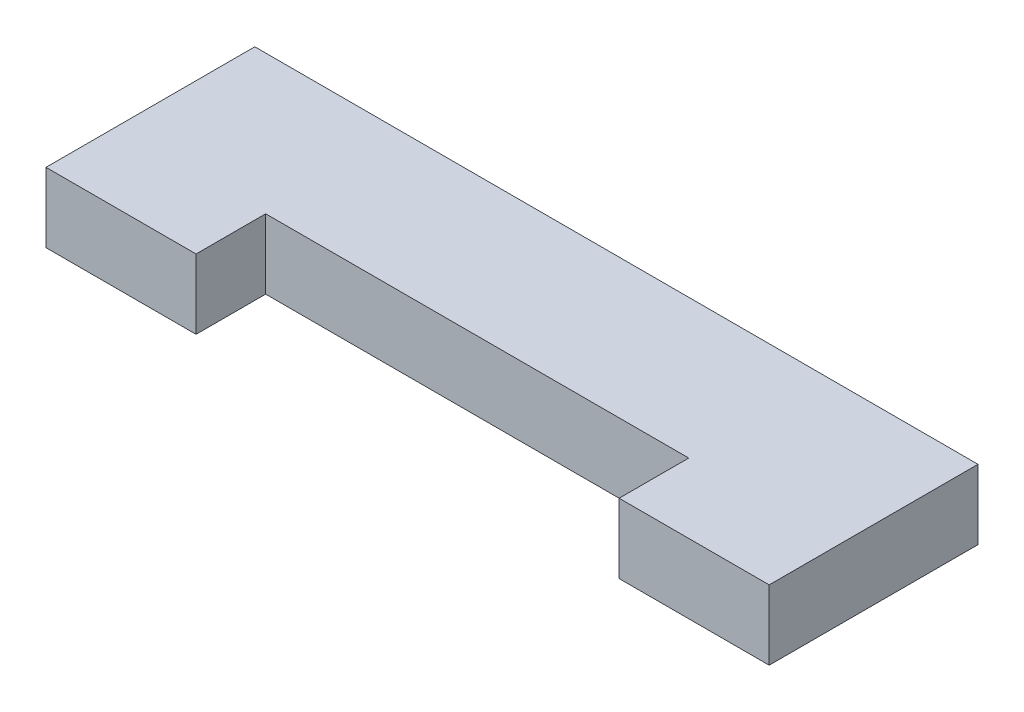
ISO-10303-21;
HEADER;
FILE_DESCRIPTION(('STEP AP214'),'2;1');
FILE_NAME('part.step','',(''),(''),'','','');
FILE_SCHEMA(('AUTOMOTIVE_DESIGN { 1 0 10303 214 1 1 1 1 }'));
ENDSEC;
DATA;
#1=APPLICATION_CONTEXT('core data for automotive mechanical design processes');
#2=APPLICATION_PROTOCOL_DEFINITION('international standard','automotive_design',2000,#1);
#3=PRODUCT_CONTEXT('',#1,'mechanical');
#4=PRODUCT('Part','Part','',(#3));
#5=PRODUCT_RELATED_PRODUCT_CATEGORY('part','',(#4));
#6=PRODUCT_DEFINITION_FORMATION('','',#4);
#7=PRODUCT_DEFINITION_CONTEXT('part definition',#1,'design');
#8=PRODUCT_DEFINITION('design','',#6,#7);
#9=PRODUCT_DEFINITION_SHAPE('','',#8);
#10=(LENGTH_UNIT() NAMED_UNIT(*) SI_UNIT(.MILLI.,.METRE.));
#11=(NAMED_UNIT(*) PLANE_ANGLE_UNIT() SI_UNIT($,.RADIAN.));
#12=(NAMED_UNIT(*) SI_UNIT($,.STERADIAN.) SOLID_ANGLE_UNIT());
#13=UNCERTAINTY_MEASURE_WITH_UNIT(LENGTH_MEASURE(1.E-05),#10,'distance_accuracy_value','');
#14=(GEOMETRIC_REPRESENTATION_CONTEXT(3) GLOBAL_UNCERTAINTY_ASSIGNED_CONTEXT((#13)) GLOBAL_UNIT_ASSIGNED_CONTEXT((#10,
#11,#12)) REPRESENTATION_CONTEXT('',''));
#15=CARTESIAN_POINT('',(0.,0.,0.));
#16=DIRECTION('',(0.,0.,1.));
#17=DIRECTION('',(1.,0.,0.));
#18=AXIS2_PLACEMENT_3D('',#15,#16,#17);
#19=CARTESIAN_POINT('',(-20.,3.85,-3.85));
#20=DIRECTION('',(0.,0.,1.));
#21=DIRECTION('',(1.,0.,0.));
#22=AXIS2_PLACEMENT_3D('',#19,#20,#21);
#23=PLANE('',#22);
#24=DIRECTION('',(-1.,0.,0.));
#25=VECTOR('',#24,1.);
#26=CARTESIAN_POINT('',(-20.,0.,-3.85));
#27=LINE('',#26,#25);
#28=CARTESIAN_POINT('',(20.,0.,-3.85));
#29=VERTEX_POINT('',#28);
#30=CARTESIAN_POINT('',(-20.,0.,-3.85));
#31=VERTEX_POINT('',#30);
#32=EDGE_CURVE('E132',#29,#31,#27,.T.);
#33=ORIENTED_EDGE('',*,*,#32,.T.);
#34=DIRECTION('',(0.,-1.,0.));
#35=VECTOR('',#34,1.);
#36=CARTESIAN_POINT('',(-20.,3.85,-3.85));
#37=LINE('',#36,#35);
#38=CARTESIAN_POINT('',(-20.,3.85,-3.85));
#39=VERTEX_POINT('',#38);
#40=EDGE_CURVE('E40',#39,#31,#37,.T.);
#41=ORIENTED_EDGE('',*,*,#40,.F.);
#42=DIRECTION('',(-1.,0.,0.));
#43=VECTOR('',#42,1.);
#44=CARTESIAN_POINT('',(-20.,3.85,-3.85));
#45=LINE('',#44,#43);
#46=CARTESIAN_POINT('',(20.,3.85,-3.85));
#47=VERTEX_POINT('',#46);
#48=EDGE_CURVE('E92',#47,#39,#45,.T.);
#49=ORIENTED_EDGE('',*,*,#48,.F.);
#50=DIRECTION('',(0.,-1.,0.));
#51=VECTOR('',#50,1.);
#52=CARTESIAN_POINT('',(20.,3.85,-3.85));
#53=LINE('',#52,#51);
#54=EDGE_CURVE('E11',#47,#29,#53,.T.);
#55=ORIENTED_EDGE('',*,*,#54,.T.);
#56=EDGE_LOOP('',(#33,#41,#49,#55));
#57=FACE_BOUND('',#56,.T.);
#58=ADVANCED_FACE('F32',(#57),#23,.F.);
#59=CARTESIAN_POINT('',(-20.,3.85,3.85));
#60=DIRECTION('',(1.,0.,0.));
#61=DIRECTION('',(0.,0.,-1.));
#62=AXIS2_PLACEMENT_3D('',#59,#60,#61);
#63=PLANE('',#62);
#64=DIRECTION('',(0.,0.,1.));
#65=VECTOR('',#64,1.);
#66=CARTESIAN_POINT('',(-20.,0.,3.85));
#67=LINE('',#66,#65);
#68=CARTESIAN_POINT('',(-20.,0.,7.7));
#69=VERTEX_POINT('',#68);
#70=EDGE_CURVE('E135',#31,#69,#67,.T.);
#71=ORIENTED_EDGE('',*,*,#70,.T.);
#72=DIRECTION('',(0.,-1.,0.));
#73=VECTOR('',#72,1.);
#74=CARTESIAN_POINT('',(-20.,3.85,7.7));
#75=LINE('',#74,#73);
#76=CARTESIAN_POINT('',(-20.,3.85,7.7));
#77=VERTEX_POINT('',#76);
#78=EDGE_CURVE('E152',#77,#69,#75,.T.);
#79=ORIENTED_EDGE('',*,*,#78,.F.);
#80=DIRECTION('',(0.,0.,1.));
#81=VECTOR('',#80,1.);
#82=CARTESIAN_POINT('',(-20.,3.85,3.85));
#83=LINE('',#82,#81);
#84=EDGE_CURVE('E159',#39,#77,#83,.T.);
#85=ORIENTED_EDGE('',*,*,#84,.F.);
#86=ORIENTED_EDGE('',*,*,#40,.T.);
#87=EDGE_LOOP('',(#71,#79,#85,#86));
#88=FACE_BOUND('',#87,.T.);
#89=ADVANCED_FACE('F157',(#88),#63,.F.);
#90=CARTESIAN_POINT('',(-20.,3.85,7.7));
#91=DIRECTION('',(0.,0.,-1.));
#92=DIRECTION('',(-1.,0.,0.));
#93=AXIS2_PLACEMENT_3D('',#90,#91,#92);
#94=PLANE('',#93);
#95=DIRECTION('',(1.,0.,0.));
#96=VECTOR('',#95,1.);
#97=CARTESIAN_POINT('',(-20.,0.,7.7));
#98=LINE('',#97,#96);
#99=CARTESIAN_POINT('',(-11.7,0.,7.7));
#100=VERTEX_POINT('',#99);
#101=EDGE_CURVE('E137',#69,#100,#98,.T.);
#102=ORIENTED_EDGE('',*,*,#101,.T.);
#103=DIRECTION('',(0.,-1.,0.));
#104=VECTOR('',#103,1.);
#105=CARTESIAN_POINT('',(-11.7,3.85,7.7));
#106=LINE('',#105,#104);
#107=CARTESIAN_POINT('',(-11.7,3.85,7.7));
#108=VERTEX_POINT('',#107);
#109=EDGE_CURVE('E149',#108,#100,#106,.T.);
#110=ORIENTED_EDGE('',*,*,#109,.F.);
#111=DIRECTION('',(1.,0.,0.));
#112=VECTOR('',#111,1.);
#113=CARTESIAN_POINT('',(-20.,3.85,7.7));
#114=LINE('',#113,#112);
#115=EDGE_CURVE('E172',#77,#108,#114,.T.);
#116=ORIENTED_EDGE('',*,*,#115,.F.);
#117=ORIENTED_EDGE('',*,*,#78,.T.);
#118=EDGE_LOOP('',(#102,#110,#116,#117));
#119=FACE_BOUND('',#118,.T.);
#120=ADVANCED_FACE('F168',(#119),#94,.F.);
#121=CARTESIAN_POINT('',(-11.7,3.85,7.7));
#122=DIRECTION('',(-1.,0.,0.));
#123=DIRECTION('',(0.,0.,1.));
#124=AXIS2_PLACEMENT_3D('',#121,#122,#123);
#125=PLANE('',#124);
#126=DIRECTION('',(0.,0.,-1.));
#127=VECTOR('',#126,1.);
#128=CARTESIAN_POINT('',(-11.7,0.,7.7));
#129=LINE('',#128,#127);
#130=CARTESIAN_POINT('',(-11.7,0.,3.85));
#131=VERTEX_POINT('',#130);
#132=EDGE_CURVE('E139',#100,#131,#129,.T.);
#133=ORIENTED_EDGE('',*,*,#132,.T.);
#134=DIRECTION('',(0.,-1.,0.));
#135=VECTOR('',#134,1.);
#136=CARTESIAN_POINT('',(-11.7,3.85,3.85));
#137=LINE('',#136,#135);
#138=CARTESIAN_POINT('',(-11.7,3.85,3.85));
#139=VERTEX_POINT('',#138);
#140=EDGE_CURVE('E121',#139,#131,#137,.T.);
#141=ORIENTED_EDGE('',*,*,#140,.F.);
#142=DIRECTION('',(0.,0.,-1.));
#143=VECTOR('',#142,1.);
#144=CARTESIAN_POINT('',(-11.7,3.85,7.7));
#145=LINE('',#144,#143);
#146=EDGE_CURVE('E112',#108,#139,#145,.T.);
#147=ORIENTED_EDGE('',*,*,#146,.F.);
#148=ORIENTED_EDGE('',*,*,#109,.T.);
#149=EDGE_LOOP('',(#133,#141,#147,#148));
#150=FACE_BOUND('',#149,.T.);
#151=ADVANCED_FACE('F171',(#150),#125,.F.);
#152=CARTESIAN_POINT('',(-11.7,3.85,3.85));
#153=DIRECTION('',(0.,0.,-1.));
#154=DIRECTION('',(-1.,0.,0.));
#155=AXIS2_PLACEMENT_3D('',#152,#153,#154);
#156=PLANE('',#155);
#157=DIRECTION('',(1.,0.,0.));
#158=VECTOR('',#157,1.);
#159=CARTESIAN_POINT('',(-11.7,0.,3.85));
#160=LINE('',#159,#158);
#161=CARTESIAN_POINT('',(11.7,0.,3.85));
#162=VERTEX_POINT('',#161);
#163=EDGE_CURVE('E120',#131,#162,#160,.T.);
#164=ORIENTED_EDGE('',*,*,#163,.T.);
#165=DIRECTION('',(0.,-1.,0.));
#166=VECTOR('',#165,1.);
#167=CARTESIAN_POINT('',(11.7,3.85,3.85));
#168=LINE('',#167,#166);
#169=CARTESIAN_POINT('',(11.7,3.85,3.85));
#170=VERTEX_POINT('',#169);
#171=EDGE_CURVE('E117',#170,#162,#168,.T.);
#172=ORIENTED_EDGE('',*,*,#171,.F.);
#173=DIRECTION('',(1.,0.,0.));
#174=VECTOR('',#173,1.);
#175=CARTESIAN_POINT('',(-11.7,3.85,3.85));
#176=LINE('',#175,#174);
#177=EDGE_CURVE('E106',#139,#170,#176,.T.);
#178=ORIENTED_EDGE('',*,*,#177,.F.);
#179=ORIENTED_EDGE('',*,*,#140,.T.);
#180=EDGE_LOOP('',(#164,#172,#178,#179));
#181=FACE_BOUND('',#180,.T.);
#182=ADVANCED_FACE('F118',(#181),#156,.F.);
#183=CARTESIAN_POINT('',(11.7,3.85,7.7));
#184=DIRECTION('',(1.,0.,0.));
#185=DIRECTION('',(0.,0.,-1.));
#186=AXIS2_PLACEMENT_3D('',#183,#184,#185);
#187=PLANE('',#186);
#188=DIRECTION('',(0.,0.,1.));
#189=VECTOR('',#188,1.);
#190=CARTESIAN_POINT('',(11.7,0.,7.7));
#191=LINE('',#190,#189);
#192=CARTESIAN_POINT('',(11.7,0.,7.7));
#193=VERTEX_POINT('',#192);
#194=EDGE_CURVE('E78',#162,#193,#191,.T.);
#195=ORIENTED_EDGE('',*,*,#194,.T.);
#196=DIRECTION('',(0.,-1.,0.));
#197=VECTOR('',#196,1.);
#198=CARTESIAN_POINT('',(11.7,3.85,7.7));
#199=LINE('',#198,#197);
#200=CARTESIAN_POINT('',(11.7,3.85,7.7));
#201=VERTEX_POINT('',#200);
#202=EDGE_CURVE('E122',#201,#193,#199,.T.);
#203=ORIENTED_EDGE('',*,*,#202,.F.);
#204=DIRECTION('',(0.,0.,1.));
#205=VECTOR('',#204,1.);
#206=CARTESIAN_POINT('',(11.7,3.85,7.7));
#207=LINE('',#206,#205);
#208=EDGE_CURVE('E110',#170,#201,#207,.T.);
#209=ORIENTED_EDGE('',*,*,#208,.F.);
#210=ORIENTED_EDGE('',*,*,#171,.T.);
#211=EDGE_LOOP('',(#195,#203,#209,#210));
#212=FACE_BOUND('',#211,.T.);
#213=ADVANCED_FACE('F124',(#212),#187,.F.);
#214=CARTESIAN_POINT('',(20.,3.85,7.7));
#215=DIRECTION('',(0.,0.,-1.));
#216=DIRECTION('',(-1.,0.,0.));
#217=AXIS2_PLACEMENT_3D('',#214,#215,#216);
#218=PLANE('',#217);
#219=DIRECTION('',(1.,0.,0.));
#220=VECTOR('',#219,1.);
#221=CARTESIAN_POINT('',(20.,0.,7.7));
#222=LINE('',#221,#220);
#223=CARTESIAN_POINT('',(20.,0.,7.7));
#224=VERTEX_POINT('',#223);
#225=EDGE_CURVE('E85',#193,#224,#222,.T.);
#226=ORIENTED_EDGE('',*,*,#225,.T.);
#227=DIRECTION('',(0.,-1.,0.));
#228=VECTOR('',#227,1.);
#229=CARTESIAN_POINT('',(20.,3.85,7.7));
#230=LINE('',#229,#228);
#231=CARTESIAN_POINT('',(20.,3.85,7.7));
#232=VERTEX_POINT('',#231);
#233=EDGE_CURVE('E128',#232,#224,#230,.T.);
#234=ORIENTED_EDGE('',*,*,#233,.F.);
#235=DIRECTION('',(1.,0.,0.));
#236=VECTOR('',#235,1.);
#237=CARTESIAN_POINT('',(20.,3.85,7.7));
#238=LINE('',#237,#236);
#239=EDGE_CURVE('E126',#201,#232,#238,.T.);
#240=ORIENTED_EDGE('',*,*,#239,.F.);
#241=ORIENTED_EDGE('',*,*,#202,.T.);
#242=EDGE_LOOP('',(#226,#234,#240,#241));
#243=FACE_BOUND('',#242,.T.);
#244=ADVANCED_FACE('F178',(#243),#218,.F.);
#245=CARTESIAN_POINT('',(20.,3.85,3.85));
#246=DIRECTION('',(-1.,0.,0.));
#247=DIRECTION('',(0.,0.,1.));
#248=AXIS2_PLACEMENT_3D('',#245,#246,#247);
#249=PLANE('',#248);
#250=DIRECTION('',(0.,0.,-1.));
#251=VECTOR('',#250,1.);
#252=CARTESIAN_POINT('',(20.,0.,3.85));
#253=LINE('',#252,#251);
#254=EDGE_CURVE('E144',#224,#29,#253,.T.);
#255=ORIENTED_EDGE('',*,*,#254,.T.);
#256=ORIENTED_EDGE('',*,*,#54,.F.);
#257=DIRECTION('',(0.,0.,-1.));
#258=VECTOR('',#257,1.);
#259=CARTESIAN_POINT('',(20.,3.85,3.85));
#260=LINE('',#259,#258);
#261=EDGE_CURVE('E48',#232,#47,#260,.T.);
#262=ORIENTED_EDGE('',*,*,#261,.F.);
#263=ORIENTED_EDGE('',*,*,#233,.T.);
#264=EDGE_LOOP('',(#255,#256,#262,#263));
#265=FACE_BOUND('',#264,.T.);
#266=ADVANCED_FACE('F177',(#265),#249,.F.);
#267=CARTESIAN_POINT('',(0.,3.85,0.));
#268=DIRECTION('',(0.,-1.,0.));
#269=DIRECTION('',(0.,0.,-1.));
#270=AXIS2_PLACEMENT_3D('',#267,#268,#269);
#271=PLANE('',#270);
#272=ORIENTED_EDGE('',*,*,#261,.T.);
#273=ORIENTED_EDGE('',*,*,#48,.T.);
#274=ORIENTED_EDGE('',*,*,#84,.T.);
#275=ORIENTED_EDGE('',*,*,#115,.T.);
#276=ORIENTED_EDGE('',*,*,#146,.T.);
#277=ORIENTED_EDGE('',*,*,#177,.T.);
#278=ORIENTED_EDGE('',*,*,#208,.T.);
#279=ORIENTED_EDGE('',*,*,#239,.T.);
#280=EDGE_LOOP('',(#272,#273,#274,#275,#276,#277,#278,#279));
#281=FACE_BOUND('',#280,.T.);
#282=ADVANCED_FACE('F108',(#281),#271,.F.);
#283=CARTESIAN_POINT('',(0.,0.,0.));
#284=DIRECTION('',(0.,-1.,0.));
#285=DIRECTION('',(0.,0.,-1.));
#286=AXIS2_PLACEMENT_3D('',#283,#284,#285);
#287=PLANE('',#286);
#288=ORIENTED_EDGE('',*,*,#32,.F.);
#289=ORIENTED_EDGE('',*,*,#254,.F.);
#290=ORIENTED_EDGE('',*,*,#225,.F.);
#291=ORIENTED_EDGE('',*,*,#194,.F.);
#292=ORIENTED_EDGE('',*,*,#163,.F.);
#293=ORIENTED_EDGE('',*,*,#132,.F.);
#294=ORIENTED_EDGE('',*,*,#101,.F.);
#295=ORIENTED_EDGE('',*,*,#70,.F.);
#296=EDGE_LOOP('',(#288,#289,#290,#291,#292,#293,#294,#295));
#297=FACE_BOUND('',#296,.T.);
#298=ADVANCED_FACE('F163',(#297),#287,.T.);
#299=CLOSED_SHELL('',(#58,#89,#120,#151,#182,#213,#244,#266,#282,#298));
#300=MANIFOLD_SOLID_BREP('B2',#299);
#301=ADVANCED_BREP_SHAPE_REPRESENTATION('',(#18,#300),#14);
#302=SHAPE_DEFINITION_REPRESENTATION(#9,#301);
ENDSEC;
END-ISO-10303-21;
